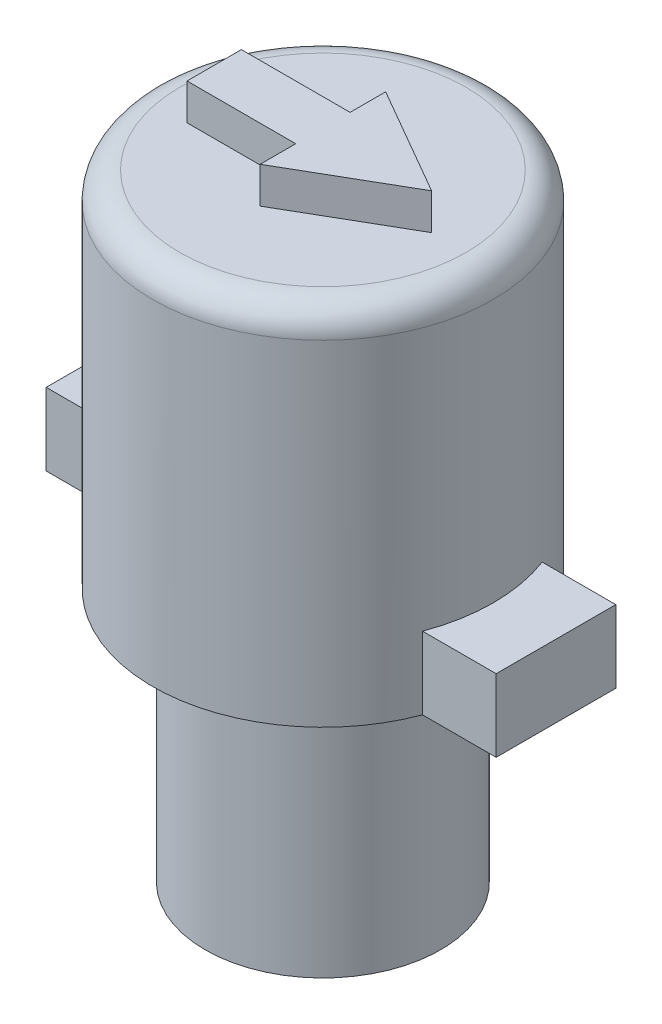
ISO-10303-21;
HEADER;
FILE_DESCRIPTION(('STEP AP214'),'2;1');
FILE_NAME('part.step','',(''),(''),'','','');
FILE_SCHEMA(('AUTOMOTIVE_DESIGN { 1 0 10303 214 1 1 1 1 }'));
ENDSEC;
DATA;
#1=APPLICATION_CONTEXT('core data for automotive mechanical design processes');
#2=APPLICATION_PROTOCOL_DEFINITION('international standard','automotive_design',2000,#1);
#3=PRODUCT_CONTEXT('',#1,'mechanical');
#4=PRODUCT('Part','Part','',(#3));
#5=PRODUCT_RELATED_PRODUCT_CATEGORY('part','',(#4));
#6=PRODUCT_DEFINITION_FORMATION('','',#4);
#7=PRODUCT_DEFINITION_CONTEXT('part definition',#1,'design');
#8=PRODUCT_DEFINITION('design','',#6,#7);
#9=PRODUCT_DEFINITION_SHAPE('','',#8);
#10=(LENGTH_UNIT() NAMED_UNIT(*) SI_UNIT(.MILLI.,.METRE.));
#11=(NAMED_UNIT(*) PLANE_ANGLE_UNIT() SI_UNIT($,.RADIAN.));
#12=(NAMED_UNIT(*) SI_UNIT($,.STERADIAN.) SOLID_ANGLE_UNIT());
#13=UNCERTAINTY_MEASURE_WITH_UNIT(LENGTH_MEASURE(1.E-05),#10,'distance_accuracy_value','');
#14=(GEOMETRIC_REPRESENTATION_CONTEXT(3) GLOBAL_UNCERTAINTY_ASSIGNED_CONTEXT((#13)) GLOBAL_UNIT_ASSIGNED_CONTEXT((#10,
#11,#12)) REPRESENTATION_CONTEXT('',''));
#15=CARTESIAN_POINT('',(0.,0.,0.));
#16=DIRECTION('',(0.,0.,1.));
#17=DIRECTION('',(1.,0.,0.));
#18=AXIS2_PLACEMENT_3D('',#15,#16,#17);
#19=CARTESIAN_POINT('',(0.,17.018,0.));
#20=DIRECTION('',(0.,1.,0.));
#21=DIRECTION('',(0.,0.,1.));
#22=AXIS2_PLACEMENT_3D('',#19,#20,#21);
#23=PLANE('',#22);
#24=CARTESIAN_POINT('',(0.,17.018,0.));
#25=DIRECTION('',(0.,1.,0.));
#26=DIRECTION('',(0.,0.,1.));
#27=AXIS2_PLACEMENT_3D('',#24,#25,#26);
#28=CIRCLE('',#27,3.95);
#29=CARTESIAN_POINT('',(0.,17.018,3.95));
#30=VERTEX_POINT('',#29);
#31=EDGE_CURVE('E72',#30,#30,#28,.T.);
#32=ORIENTED_EDGE('',*,*,#31,.T.);
#33=EDGE_LOOP('',(#32));
#34=FACE_BOUND('',#33,.T.);
#35=DIRECTION('',(-1.,0.,0.));
#36=VECTOR('',#35,1.);
#37=CARTESIAN_POINT('',(0.,17.018,-0.75));
#38=LINE('',#37,#36);
#39=CARTESIAN_POINT('',(0.,17.018,-0.75));
#40=VERTEX_POINT('',#39);
#41=CARTESIAN_POINT('',(-3.,17.018,-0.75));
#42=VERTEX_POINT('',#41);
#43=EDGE_CURVE('E285',#40,#42,#38,.T.);
#44=ORIENTED_EDGE('',*,*,#43,.F.);
#45=DIRECTION('',(0.,0.,1.));
#46=VECTOR('',#45,1.);
#47=CARTESIAN_POINT('',(0.,17.018,-1.73205080756888));
#48=LINE('',#47,#46);
#49=CARTESIAN_POINT('',(0.,17.018,-1.73205080756888));
#50=VERTEX_POINT('',#49);
#51=EDGE_CURVE('E213',#50,#40,#48,.T.);
#52=ORIENTED_EDGE('',*,*,#51,.F.);
#53=DIRECTION('',(-0.866025403784438,0.,-0.5));
#54=VECTOR('',#53,1.);
#55=CARTESIAN_POINT('',(3.,17.018,0.));
#56=LINE('',#55,#54);
#57=CARTESIAN_POINT('',(3.,17.018,0.));
#58=VERTEX_POINT('',#57);
#59=EDGE_CURVE('E263',#58,#50,#56,.T.);
#60=ORIENTED_EDGE('',*,*,#59,.F.);
#61=DIRECTION('',(0.866025403784439,0.,-0.5));
#62=VECTOR('',#61,1.);
#63=CARTESIAN_POINT('',(0.,17.018,1.73205080756888));
#64=LINE('',#63,#62);
#65=CARTESIAN_POINT('',(0.,17.018,1.73205080756888));
#66=VERTEX_POINT('',#65);
#67=EDGE_CURVE('E297',#66,#58,#64,.T.);
#68=ORIENTED_EDGE('',*,*,#67,.F.);
#69=DIRECTION('',(0.,0.,1.));
#70=VECTOR('',#69,1.);
#71=CARTESIAN_POINT('',(0.,17.018,0.75));
#72=LINE('',#71,#70);
#73=CARTESIAN_POINT('',(0.,17.018,0.75));
#74=VERTEX_POINT('',#73);
#75=EDGE_CURVE('E294',#74,#66,#72,.T.);
#76=ORIENTED_EDGE('',*,*,#75,.F.);
#77=DIRECTION('',(1.,0.,0.));
#78=VECTOR('',#77,1.);
#79=CARTESIAN_POINT('',(-3.,17.018,0.75));
#80=LINE('',#79,#78);
#81=CARTESIAN_POINT('',(-3.,17.018,0.75));
#82=VERTEX_POINT('',#81);
#83=EDGE_CURVE('E291',#82,#74,#80,.T.);
#84=ORIENTED_EDGE('',*,*,#83,.F.);
#85=DIRECTION('',(0.,0.,1.));
#86=VECTOR('',#85,1.);
#87=CARTESIAN_POINT('',(-3.,17.018,-0.75));
#88=LINE('',#87,#86);
#89=EDGE_CURVE('E288',#42,#82,#88,.T.);
#90=ORIENTED_EDGE('',*,*,#89,.F.);
#91=EDGE_LOOP('',(#44,#52,#60,#68,#76,#84,#90));
#92=FACE_BOUND('',#91,.T.);
#93=ADVANCED_FACE('F63',(#34,#92),#23,.T.);
#94=CARTESIAN_POINT('',(0.,7.018,0.));
#95=DIRECTION('',(0.,-1.,0.));
#96=DIRECTION('',(0.,0.,-1.));
#97=AXIS2_PLACEMENT_3D('',#94,#95,#96);
#98=CYLINDRICAL_SURFACE('',#97,3.25);
#99=CARTESIAN_POINT('',(0.,7.018,0.));
#100=DIRECTION('',(0.,1.,0.));
#101=DIRECTION('',(0.,0.,1.));
#102=AXIS2_PLACEMENT_3D('',#99,#100,#101);
#103=CIRCLE('',#102,3.25);
#104=CARTESIAN_POINT('',(0.,7.018,3.25));
#105=VERTEX_POINT('',#104);
#106=EDGE_CURVE('E332',#105,#105,#103,.T.);
#107=ORIENTED_EDGE('',*,*,#106,.F.);
#108=EDGE_LOOP('',(#107));
#109=FACE_BOUND('',#108,.T.);
#110=CARTESIAN_POINT('',(0.,0.,0.));
#111=DIRECTION('',(0.,1.,0.));
#112=DIRECTION('',(0.,0.,1.));
#113=AXIS2_PLACEMENT_3D('',#110,#111,#112);
#114=CIRCLE('',#113,3.25);
#115=CARTESIAN_POINT('',(0.,0.,3.25));
#116=VERTEX_POINT('',#115);
#117=EDGE_CURVE('E336',#116,#116,#114,.T.);
#118=ORIENTED_EDGE('',*,*,#117,.T.);
#119=EDGE_LOOP('',(#118));
#120=FACE_BOUND('',#119,.T.);
#121=ADVANCED_FACE('F362',(#109,#120),#98,.T.);
#122=CARTESIAN_POINT('',(0.,0.,0.));
#123=DIRECTION('',(0.,1.,0.));
#124=DIRECTION('',(0.,0.,1.));
#125=AXIS2_PLACEMENT_3D('',#122,#123,#124);
#126=PLANE('',#125);
#127=ORIENTED_EDGE('',*,*,#117,.F.);
#128=EDGE_LOOP('',(#127));
#129=FACE_BOUND('',#128,.T.);
#130=ADVANCED_FACE('F367',(#129),#126,.F.);
#131=CARTESIAN_POINT('',(0.,17.018,0.));
#132=DIRECTION('',(0.,-1.,0.));
#133=DIRECTION('',(0.,0.,-1.));
#134=AXIS2_PLACEMENT_3D('',#131,#132,#133);
#135=CYLINDRICAL_SURFACE('',#134,4.7);
#136=CARTESIAN_POINT('',(0.,7.018,0.));
#137=DIRECTION('',(0.,1.,0.));
#138=DIRECTION('',(0.,0.,1.));
#139=AXIS2_PLACEMENT_3D('',#136,#137,#138);
#140=CIRCLE('',#139,4.7);
#141=CARTESIAN_POINT('',(4.4004771332209,7.018,-1.651));
#142=VERTEX_POINT('',#141);
#143=CARTESIAN_POINT('',(-4.58887175676113,7.018,-1.016));
#144=VERTEX_POINT('',#143);
#145=EDGE_CURVE('E331',#142,#144,#140,.T.);
#146=ORIENTED_EDGE('',*,*,#145,.T.);
#147=DIRECTION('',(0.,-1.,0.));
#148=VECTOR('',#147,1.);
#149=CARTESIAN_POINT('',(-4.58887175676113,9.018,-1.016));
#150=LINE('',#149,#148);
#151=CARTESIAN_POINT('',(-4.58887175676113,9.018,-1.016));
#152=VERTEX_POINT('',#151);
#153=EDGE_CURVE('E79',#152,#144,#150,.T.);
#154=ORIENTED_EDGE('',*,*,#153,.F.);
#155=CARTESIAN_POINT('',(0.,9.018,0.));
#156=DIRECTION('',(0.,1.,0.));
#157=DIRECTION('',(0.,0.,-1.));
#158=AXIS2_PLACEMENT_3D('',#155,#156,#157);
#159=CIRCLE('',#158,4.7);
#160=CARTESIAN_POINT('',(-4.58887175676113,9.018,1.016));
#161=VERTEX_POINT('',#160);
#162=EDGE_CURVE('E83',#152,#161,#159,.T.);
#163=ORIENTED_EDGE('',*,*,#162,.T.);
#164=DIRECTION('',(0.,-1.,0.));
#165=VECTOR('',#164,1.);
#166=CARTESIAN_POINT('',(-4.58887175676113,9.018,1.016));
#167=LINE('',#166,#165);
#168=CARTESIAN_POINT('',(-4.58887175676113,7.018,1.016));
#169=VERTEX_POINT('',#168);
#170=EDGE_CURVE('E183',#161,#169,#167,.T.);
#171=ORIENTED_EDGE('',*,*,#170,.T.);
#172=CARTESIAN_POINT('',(4.4004771332209,7.018,1.651));
#173=VERTEX_POINT('',#172);
#174=EDGE_CURVE('E328',#169,#173,#140,.T.);
#175=ORIENTED_EDGE('',*,*,#174,.T.);
#176=DIRECTION('',(0.,-1.,0.));
#177=VECTOR('',#176,1.);
#178=CARTESIAN_POINT('',(4.4004771332209,9.018,1.651));
#179=LINE('',#178,#177);
#180=CARTESIAN_POINT('',(4.4004771332209,9.018,1.651));
#181=VERTEX_POINT('',#180);
#182=EDGE_CURVE('E229',#181,#173,#179,.T.);
#183=ORIENTED_EDGE('',*,*,#182,.F.);
#184=CARTESIAN_POINT('',(0.,9.018,0.));
#185=DIRECTION('',(0.,1.,0.));
#186=DIRECTION('',(0.,0.,-1.));
#187=AXIS2_PLACEMENT_3D('',#184,#185,#186);
#188=CIRCLE('',#187,4.7);
#189=CARTESIAN_POINT('',(4.4004771332209,9.018,-1.651));
#190=VERTEX_POINT('',#189);
#191=EDGE_CURVE('E238',#181,#190,#188,.T.);
#192=ORIENTED_EDGE('',*,*,#191,.T.);
#193=DIRECTION('',(0.,-1.,0.));
#194=VECTOR('',#193,1.);
#195=CARTESIAN_POINT('',(4.4004771332209,9.018,-1.651));
#196=LINE('',#195,#194);
#197=EDGE_CURVE('E218',#190,#142,#196,.T.);
#198=ORIENTED_EDGE('',*,*,#197,.T.);
#199=EDGE_LOOP('',(#146,#154,#163,#171,#175,#183,#192,#198));
#200=FACE_BOUND('',#199,.T.);
#201=CARTESIAN_POINT('',(0.,16.268,0.));
#202=DIRECTION('',(0.,1.,0.));
#203=DIRECTION('',(0.,0.,1.));
#204=AXIS2_PLACEMENT_3D('',#201,#202,#203);
#205=CIRCLE('',#204,4.7);
#206=CARTESIAN_POINT('',(0.,16.268,4.7));
#207=VERTEX_POINT('',#206);
#208=EDGE_CURVE('E12',#207,#207,#205,.F.);
#209=ORIENTED_EDGE('',*,*,#208,.T.);
#210=EDGE_LOOP('',(#209));
#211=FACE_BOUND('',#210,.T.);
#212=ADVANCED_FACE('F358',(#200,#211),#135,.T.);
#213=CARTESIAN_POINT('',(0.,7.018,0.));
#214=DIRECTION('',(0.,1.,0.));
#215=DIRECTION('',(0.,0.,1.));
#216=AXIS2_PLACEMENT_3D('',#213,#214,#215);
#217=PLANE('',#216);
#218=ORIENTED_EDGE('',*,*,#106,.T.);
#219=EDGE_LOOP('',(#218));
#220=FACE_BOUND('',#219,.T.);
#221=ORIENTED_EDGE('',*,*,#145,.F.);
#222=DIRECTION('',(1.,0.,0.));
#223=VECTOR('',#222,1.);
#224=CARTESIAN_POINT('',(6.4324771332209,7.018,-1.651));
#225=LINE('',#224,#223);
#226=CARTESIAN_POINT('',(6.4324771332209,7.018,-1.651));
#227=VERTEX_POINT('',#226);
#228=EDGE_CURVE('E205',#142,#227,#225,.T.);
#229=ORIENTED_EDGE('',*,*,#228,.T.);
#230=DIRECTION('',(0.,0.,1.));
#231=VECTOR('',#230,1.);
#232=CARTESIAN_POINT('',(6.4324771332209,7.018,1.651));
#233=LINE('',#232,#231);
#234=CARTESIAN_POINT('',(6.4324771332209,7.018,1.651));
#235=VERTEX_POINT('',#234);
#236=EDGE_CURVE('E237',#227,#235,#233,.T.);
#237=ORIENTED_EDGE('',*,*,#236,.T.);
#238=DIRECTION('',(-1.,0.,0.));
#239=VECTOR('',#238,1.);
#240=CARTESIAN_POINT('',(4.4004771332209,7.018,1.651));
#241=LINE('',#240,#239);
#242=EDGE_CURVE('E233',#235,#173,#241,.T.);
#243=ORIENTED_EDGE('',*,*,#242,.T.);
#244=ORIENTED_EDGE('',*,*,#174,.F.);
#245=DIRECTION('',(-1.,0.,0.));
#246=VECTOR('',#245,1.);
#247=CARTESIAN_POINT('',(-4.58887175676113,7.018,1.016));
#248=LINE('',#247,#246);
#249=CARTESIAN_POINT('',(-6.62087175676113,7.018,1.016));
#250=VERTEX_POINT('',#249);
#251=EDGE_CURVE('E202',#169,#250,#248,.T.);
#252=ORIENTED_EDGE('',*,*,#251,.T.);
#253=DIRECTION('',(0.,0.,-1.));
#254=VECTOR('',#253,1.);
#255=CARTESIAN_POINT('',(-6.62087175676113,7.018,1.016));
#256=LINE('',#255,#254);
#257=CARTESIAN_POINT('',(-6.62087175676113,7.018,-1.016));
#258=VERTEX_POINT('',#257);
#259=EDGE_CURVE('E176',#250,#258,#256,.T.);
#260=ORIENTED_EDGE('',*,*,#259,.T.);
#261=DIRECTION('',(1.,0.,0.));
#262=VECTOR('',#261,1.);
#263=CARTESIAN_POINT('',(-6.62087175676113,7.018,-1.016));
#264=LINE('',#263,#262);
#265=EDGE_CURVE('E197',#258,#144,#264,.T.);
#266=ORIENTED_EDGE('',*,*,#265,.T.);
#267=EDGE_LOOP('',(#221,#229,#237,#243,#244,#252,#260,#266));
#268=FACE_BOUND('',#267,.T.);
#269=ADVANCED_FACE('F347',(#220,#268),#217,.F.);
#270=CARTESIAN_POINT('',(0.,16.268,0.));
#271=DIRECTION('',(0.,1.,0.));
#272=DIRECTION('',(0.,0.,1.));
#273=AXIS2_PLACEMENT_3D('',#270,#271,#272);
#274=TOROIDAL_SURFACE('',#273,3.95,0.75);
#275=ORIENTED_EDGE('',*,*,#208,.F.);
#276=EDGE_LOOP('',(#275));
#277=FACE_BOUND('',#276,.T.);
#278=ORIENTED_EDGE('',*,*,#31,.F.);
#279=EDGE_LOOP('',(#278));
#280=FACE_BOUND('',#279,.T.);
#281=ADVANCED_FACE('F65',(#277,#280),#274,.T.);
#282=CARTESIAN_POINT('',(0.,18.018,-1.73205080756888));
#283=DIRECTION('',(1.,0.,0.));
#284=DIRECTION('',(0.,0.,-1.));
#285=AXIS2_PLACEMENT_3D('',#282,#283,#284);
#286=PLANE('',#285);
#287=ORIENTED_EDGE('',*,*,#51,.T.);
#288=DIRECTION('',(0.,-1.,0.));
#289=VECTOR('',#288,1.);
#290=CARTESIAN_POINT('',(0.,18.018,-0.75));
#291=LINE('',#290,#289);
#292=CARTESIAN_POINT('',(0.,18.018,-0.75));
#293=VERTEX_POINT('',#292);
#294=EDGE_CURVE('E325',#293,#40,#291,.T.);
#295=ORIENTED_EDGE('',*,*,#294,.F.);
#296=DIRECTION('',(0.,0.,1.));
#297=VECTOR('',#296,1.);
#298=CARTESIAN_POINT('',(0.,18.018,-1.73205080756888));
#299=LINE('',#298,#297);
#300=CARTESIAN_POINT('',(0.,18.018,-1.73205080756888));
#301=VERTEX_POINT('',#300);
#302=EDGE_CURVE('E258',#301,#293,#299,.T.);
#303=ORIENTED_EDGE('',*,*,#302,.F.);
#304=DIRECTION('',(0.,-1.,0.));
#305=VECTOR('',#304,1.);
#306=CARTESIAN_POINT('',(0.,18.018,-1.73205080756888));
#307=LINE('',#306,#305);
#308=EDGE_CURVE('E281',#301,#50,#307,.T.);
#309=ORIENTED_EDGE('',*,*,#308,.T.);
#310=EDGE_LOOP('',(#287,#295,#303,#309));
#311=FACE_BOUND('',#310,.T.);
#312=ADVANCED_FACE('F346',(#311),#286,.F.);
#313=CARTESIAN_POINT('',(0.,18.018,-0.75));
#314=DIRECTION('',(0.,0.,1.));
#315=DIRECTION('',(1.,0.,0.));
#316=AXIS2_PLACEMENT_3D('',#313,#314,#315);
#317=PLANE('',#316);
#318=ORIENTED_EDGE('',*,*,#43,.T.);
#319=DIRECTION('',(0.,-1.,0.));
#320=VECTOR('',#319,1.);
#321=CARTESIAN_POINT('',(-3.,18.018,-0.75));
#322=LINE('',#321,#320);
#323=CARTESIAN_POINT('',(-3.,18.018,-0.75));
#324=VERTEX_POINT('',#323);
#325=EDGE_CURVE('E321',#324,#42,#322,.T.);
#326=ORIENTED_EDGE('',*,*,#325,.F.);
#327=DIRECTION('',(-1.,0.,0.));
#328=VECTOR('',#327,1.);
#329=CARTESIAN_POINT('',(0.,18.018,-0.75));
#330=LINE('',#329,#328);
#331=EDGE_CURVE('E262',#293,#324,#330,.T.);
#332=ORIENTED_EDGE('',*,*,#331,.F.);
#333=ORIENTED_EDGE('',*,*,#294,.T.);
#334=EDGE_LOOP('',(#318,#326,#332,#333));
#335=FACE_BOUND('',#334,.T.);
#336=ADVANCED_FACE('F354',(#335),#317,.F.);
#337=CARTESIAN_POINT('',(-3.,18.018,-0.75));
#338=DIRECTION('',(1.,0.,0.));
#339=DIRECTION('',(0.,0.,-1.));
#340=AXIS2_PLACEMENT_3D('',#337,#338,#339);
#341=PLANE('',#340);
#342=ORIENTED_EDGE('',*,*,#89,.T.);
#343=DIRECTION('',(0.,-1.,0.));
#344=VECTOR('',#343,1.);
#345=CARTESIAN_POINT('',(-3.,18.018,0.75));
#346=LINE('',#345,#344);
#347=CARTESIAN_POINT('',(-3.,18.018,0.75));
#348=VERTEX_POINT('',#347);
#349=EDGE_CURVE('E317',#348,#82,#346,.T.);
#350=ORIENTED_EDGE('',*,*,#349,.F.);
#351=DIRECTION('',(0.,0.,1.));
#352=VECTOR('',#351,1.);
#353=CARTESIAN_POINT('',(-3.,18.018,-0.75));
#354=LINE('',#353,#352);
#355=EDGE_CURVE('E266',#324,#348,#354,.T.);
#356=ORIENTED_EDGE('',*,*,#355,.F.);
#357=ORIENTED_EDGE('',*,*,#325,.T.);
#358=EDGE_LOOP('',(#342,#350,#356,#357));
#359=FACE_BOUND('',#358,.T.);
#360=ADVANCED_FACE('F417',(#359),#341,.F.);
#361=CARTESIAN_POINT('',(-3.,18.018,0.75));
#362=DIRECTION('',(0.,0.,-1.));
#363=DIRECTION('',(-1.,0.,0.));
#364=AXIS2_PLACEMENT_3D('',#361,#362,#363);
#365=PLANE('',#364);
#366=ORIENTED_EDGE('',*,*,#83,.T.);
#367=DIRECTION('',(0.,-1.,0.));
#368=VECTOR('',#367,1.);
#369=CARTESIAN_POINT('',(0.,18.018,0.75));
#370=LINE('',#369,#368);
#371=CARTESIAN_POINT('',(0.,18.018,0.75));
#372=VERTEX_POINT('',#371);
#373=EDGE_CURVE('E313',#372,#74,#370,.T.);
#374=ORIENTED_EDGE('',*,*,#373,.F.);
#375=DIRECTION('',(1.,0.,0.));
#376=VECTOR('',#375,1.);
#377=CARTESIAN_POINT('',(-3.,18.018,0.75));
#378=LINE('',#377,#376);
#379=EDGE_CURVE('E269',#348,#372,#378,.T.);
#380=ORIENTED_EDGE('',*,*,#379,.F.);
#381=ORIENTED_EDGE('',*,*,#349,.T.);
#382=EDGE_LOOP('',(#366,#374,#380,#381));
#383=FACE_BOUND('',#382,.T.);
#384=ADVANCED_FACE('F425',(#383),#365,.F.);
#385=CARTESIAN_POINT('',(0.,18.018,0.75));
#386=DIRECTION('',(1.,0.,0.));
#387=DIRECTION('',(0.,0.,-1.));
#388=AXIS2_PLACEMENT_3D('',#385,#386,#387);
#389=PLANE('',#388);
#390=ORIENTED_EDGE('',*,*,#75,.T.);
#391=DIRECTION('',(0.,-1.,0.));
#392=VECTOR('',#391,1.);
#393=CARTESIAN_POINT('',(0.,18.018,1.73205080756888));
#394=LINE('',#393,#392);
#395=CARTESIAN_POINT('',(0.,18.018,1.73205080756888));
#396=VERTEX_POINT('',#395);
#397=EDGE_CURVE('E309',#396,#66,#394,.T.);
#398=ORIENTED_EDGE('',*,*,#397,.F.);
#399=DIRECTION('',(0.,0.,1.));
#400=VECTOR('',#399,1.);
#401=CARTESIAN_POINT('',(0.,18.018,0.75));
#402=LINE('',#401,#400);
#403=EDGE_CURVE('E272',#372,#396,#402,.T.);
#404=ORIENTED_EDGE('',*,*,#403,.F.);
#405=ORIENTED_EDGE('',*,*,#373,.T.);
#406=EDGE_LOOP('',(#390,#398,#404,#405));
#407=FACE_BOUND('',#406,.T.);
#408=ADVANCED_FACE('F434',(#407),#389,.F.);
#409=CARTESIAN_POINT('',(0.,18.018,1.73205080756888));
#410=DIRECTION('',(-0.5,0.,-0.866025403784439));
#411=DIRECTION('',(-0.866025403784439,0.,0.5));
#412=AXIS2_PLACEMENT_3D('',#409,#410,#411);
#413=PLANE('',#412);
#414=ORIENTED_EDGE('',*,*,#67,.T.);
#415=DIRECTION('',(0.,-1.,0.));
#416=VECTOR('',#415,1.);
#417=CARTESIAN_POINT('',(3.,18.018,0.));
#418=LINE('',#417,#416);
#419=CARTESIAN_POINT('',(3.,18.018,0.));
#420=VERTEX_POINT('',#419);
#421=EDGE_CURVE('E306',#420,#58,#418,.T.);
#422=ORIENTED_EDGE('',*,*,#421,.F.);
#423=DIRECTION('',(0.866025403784439,0.,-0.5));
#424=VECTOR('',#423,1.);
#425=CARTESIAN_POINT('',(0.,18.018,1.73205080756888));
#426=LINE('',#425,#424);
#427=EDGE_CURVE('E275',#396,#420,#426,.T.);
#428=ORIENTED_EDGE('',*,*,#427,.F.);
#429=ORIENTED_EDGE('',*,*,#397,.T.);
#430=EDGE_LOOP('',(#414,#422,#428,#429));
#431=FACE_BOUND('',#430,.T.);
#432=ADVANCED_FACE('F443',(#431),#413,.F.);
#433=CARTESIAN_POINT('',(3.,18.018,0.));
#434=DIRECTION('',(-0.5,0.,0.866025403784438));
#435=DIRECTION('',(0.866025403784438,0.,0.5));
#436=AXIS2_PLACEMENT_3D('',#433,#434,#435);
#437=PLANE('',#436);
#438=ORIENTED_EDGE('',*,*,#59,.T.);
#439=ORIENTED_EDGE('',*,*,#308,.F.);
#440=DIRECTION('',(-0.866025403784438,0.,-0.5));
#441=VECTOR('',#440,1.);
#442=CARTESIAN_POINT('',(3.,18.018,0.));
#443=LINE('',#442,#441);
#444=EDGE_CURVE('E278',#420,#301,#443,.T.);
#445=ORIENTED_EDGE('',*,*,#444,.F.);
#446=ORIENTED_EDGE('',*,*,#421,.T.);
#447=EDGE_LOOP('',(#438,#439,#445,#446));
#448=FACE_BOUND('',#447,.T.);
#449=ADVANCED_FACE('F452',(#448),#437,.F.);
#450=CARTESIAN_POINT('',(0.,18.018,0.));
#451=DIRECTION('',(0.,-1.,0.));
#452=DIRECTION('',(0.,0.,-1.));
#453=AXIS2_PLACEMENT_3D('',#450,#451,#452);
#454=PLANE('',#453);
#455=ORIENTED_EDGE('',*,*,#302,.T.);
#456=ORIENTED_EDGE('',*,*,#331,.T.);
#457=ORIENTED_EDGE('',*,*,#355,.T.);
#458=ORIENTED_EDGE('',*,*,#379,.T.);
#459=ORIENTED_EDGE('',*,*,#403,.T.);
#460=ORIENTED_EDGE('',*,*,#427,.T.);
#461=ORIENTED_EDGE('',*,*,#444,.T.);
#462=EDGE_LOOP('',(#455,#456,#457,#458,#459,#460,#461));
#463=FACE_BOUND('',#462,.T.);
#464=ADVANCED_FACE('F461',(#463),#454,.F.);
#465=CARTESIAN_POINT('',(4.4004771332209,9.018,1.651));
#466=DIRECTION('',(0.,0.,1.));
#467=DIRECTION('',(1.,0.,0.));
#468=AXIS2_PLACEMENT_3D('',#465,#466,#467);
#469=PLANE('',#468);
#470=ORIENTED_EDGE('',*,*,#242,.F.);
#471=DIRECTION('',(0.,-1.,0.));
#472=VECTOR('',#471,1.);
#473=CARTESIAN_POINT('',(6.4324771332209,9.018,1.651));
#474=LINE('',#473,#472);
#475=CARTESIAN_POINT('',(6.4324771332209,9.018,1.651));
#476=VERTEX_POINT('',#475);
#477=EDGE_CURVE('E226',#476,#235,#474,.T.);
#478=ORIENTED_EDGE('',*,*,#477,.F.);
#479=DIRECTION('',(-1.,0.,0.));
#480=VECTOR('',#479,1.);
#481=CARTESIAN_POINT('',(4.4004771332209,9.018,1.651));
#482=LINE('',#481,#480);
#483=EDGE_CURVE('E222',#476,#181,#482,.T.);
#484=ORIENTED_EDGE('',*,*,#483,.T.);
#485=ORIENTED_EDGE('',*,*,#182,.T.);
#486=EDGE_LOOP('',(#470,#478,#484,#485));
#487=FACE_BOUND('',#486,.T.);
#488=ADVANCED_FACE('F470',(#487),#469,.T.);
#489=CARTESIAN_POINT('',(6.4324771332209,9.018,1.651));
#490=DIRECTION('',(1.,0.,0.));
#491=DIRECTION('',(0.,0.,-1.));
#492=AXIS2_PLACEMENT_3D('',#489,#490,#491);
#493=PLANE('',#492);
#494=ORIENTED_EDGE('',*,*,#236,.F.);
#495=DIRECTION('',(0.,-1.,0.));
#496=VECTOR('',#495,1.);
#497=CARTESIAN_POINT('',(6.4324771332209,9.018,-1.651));
#498=LINE('',#497,#496);
#499=CARTESIAN_POINT('',(6.4324771332209,9.018,-1.651));
#500=VERTEX_POINT('',#499);
#501=EDGE_CURVE('E223',#500,#227,#498,.T.);
#502=ORIENTED_EDGE('',*,*,#501,.F.);
#503=DIRECTION('',(0.,0.,1.));
#504=VECTOR('',#503,1.);
#505=CARTESIAN_POINT('',(6.4324771332209,9.018,1.651));
#506=LINE('',#505,#504);
#507=EDGE_CURVE('E248',#500,#476,#506,.T.);
#508=ORIENTED_EDGE('',*,*,#507,.T.);
#509=ORIENTED_EDGE('',*,*,#477,.T.);
#510=EDGE_LOOP('',(#494,#502,#508,#509));
#511=FACE_BOUND('',#510,.T.);
#512=ADVANCED_FACE('F479',(#511),#493,.T.);
#513=CARTESIAN_POINT('',(6.4324771332209,9.018,-1.651));
#514=DIRECTION('',(0.,0.,-1.));
#515=DIRECTION('',(-1.,0.,0.));
#516=AXIS2_PLACEMENT_3D('',#513,#514,#515);
#517=PLANE('',#516);
#518=ORIENTED_EDGE('',*,*,#228,.F.);
#519=ORIENTED_EDGE('',*,*,#197,.F.);
#520=DIRECTION('',(1.,0.,0.));
#521=VECTOR('',#520,1.);
#522=CARTESIAN_POINT('',(6.4324771332209,9.018,-1.651));
#523=LINE('',#522,#521);
#524=EDGE_CURVE('E252',#190,#500,#523,.T.);
#525=ORIENTED_EDGE('',*,*,#524,.T.);
#526=ORIENTED_EDGE('',*,*,#501,.T.);
#527=EDGE_LOOP('',(#518,#519,#525,#526));
#528=FACE_BOUND('',#527,.T.);
#529=ADVANCED_FACE('F489',(#528),#517,.T.);
#530=CARTESIAN_POINT('',(0.,9.018,0.));
#531=DIRECTION('',(0.,-1.,0.));
#532=DIRECTION('',(0.,0.,-1.));
#533=AXIS2_PLACEMENT_3D('',#530,#531,#532);
#534=PLANE('',#533);
#535=ORIENTED_EDGE('',*,*,#191,.F.);
#536=ORIENTED_EDGE('',*,*,#483,.F.);
#537=ORIENTED_EDGE('',*,*,#507,.F.);
#538=ORIENTED_EDGE('',*,*,#524,.F.);
#539=EDGE_LOOP('',(#535,#536,#537,#538));
#540=FACE_BOUND('',#539,.T.);
#541=ADVANCED_FACE('F498',(#540),#534,.F.);
#542=CARTESIAN_POINT('',(-6.62087175676113,9.018,-1.016));
#543=DIRECTION('',(0.,0.,-1.));
#544=DIRECTION('',(-1.,0.,0.));
#545=AXIS2_PLACEMENT_3D('',#542,#543,#544);
#546=PLANE('',#545);
#547=ORIENTED_EDGE('',*,*,#265,.F.);
#548=DIRECTION('',(0.,-1.,0.));
#549=VECTOR('',#548,1.);
#550=CARTESIAN_POINT('',(-6.62087175676113,9.018,-1.016));
#551=LINE('',#550,#549);
#552=CARTESIAN_POINT('',(-6.62087175676113,9.018,-1.016));
#553=VERTEX_POINT('',#552);
#554=EDGE_CURVE('E182',#553,#258,#551,.T.);
#555=ORIENTED_EDGE('',*,*,#554,.F.);
#556=DIRECTION('',(1.,0.,0.));
#557=VECTOR('',#556,1.);
#558=CARTESIAN_POINT('',(-6.62087175676113,9.018,-1.016));
#559=LINE('',#558,#557);
#560=EDGE_CURVE('E190',#553,#152,#559,.T.);
#561=ORIENTED_EDGE('',*,*,#560,.T.);
#562=ORIENTED_EDGE('',*,*,#153,.T.);
#563=EDGE_LOOP('',(#547,#555,#561,#562));
#564=FACE_BOUND('',#563,.T.);
#565=ADVANCED_FACE('F507',(#564),#546,.T.);
#566=CARTESIAN_POINT('',(-6.62087175676113,9.018,1.016));
#567=DIRECTION('',(-1.,0.,0.));
#568=DIRECTION('',(0.,0.,1.));
#569=AXIS2_PLACEMENT_3D('',#566,#567,#568);
#570=PLANE('',#569);
#571=ORIENTED_EDGE('',*,*,#259,.F.);
#572=DIRECTION('',(0.,-1.,0.));
#573=VECTOR('',#572,1.);
#574=CARTESIAN_POINT('',(-6.62087175676113,9.018,1.016));
#575=LINE('',#574,#573);
#576=CARTESIAN_POINT('',(-6.62087175676113,9.018,1.016));
#577=VERTEX_POINT('',#576);
#578=EDGE_CURVE('E170',#577,#250,#575,.T.);
#579=ORIENTED_EDGE('',*,*,#578,.F.);
#580=DIRECTION('',(0.,0.,-1.));
#581=VECTOR('',#580,1.);
#582=CARTESIAN_POINT('',(-6.62087175676113,9.018,1.016));
#583=LINE('',#582,#581);
#584=EDGE_CURVE('E173',#577,#553,#583,.T.);
#585=ORIENTED_EDGE('',*,*,#584,.T.);
#586=ORIENTED_EDGE('',*,*,#554,.T.);
#587=EDGE_LOOP('',(#571,#579,#585,#586));
#588=FACE_BOUND('',#587,.T.);
#589=ADVANCED_FACE('F172',(#588),#570,.T.);
#590=CARTESIAN_POINT('',(-4.58887175676113,9.018,1.016));
#591=DIRECTION('',(0.,0.,1.));
#592=DIRECTION('',(1.,0.,0.));
#593=AXIS2_PLACEMENT_3D('',#590,#591,#592);
#594=PLANE('',#593);
#595=ORIENTED_EDGE('',*,*,#251,.F.);
#596=ORIENTED_EDGE('',*,*,#170,.F.);
#597=DIRECTION('',(-1.,0.,0.));
#598=VECTOR('',#597,1.);
#599=CARTESIAN_POINT('',(-4.58887175676113,9.018,1.016));
#600=LINE('',#599,#598);
#601=EDGE_CURVE('E188',#161,#577,#600,.T.);
#602=ORIENTED_EDGE('',*,*,#601,.T.);
#603=ORIENTED_EDGE('',*,*,#578,.T.);
#604=EDGE_LOOP('',(#595,#596,#602,#603));
#605=FACE_BOUND('',#604,.T.);
#606=ADVANCED_FACE('F193',(#605),#594,.T.);
#607=CARTESIAN_POINT('',(0.,9.018,0.));
#608=DIRECTION('',(0.,-1.,0.));
#609=DIRECTION('',(0.,0.,-1.));
#610=AXIS2_PLACEMENT_3D('',#607,#608,#609);
#611=PLANE('',#610);
#612=ORIENTED_EDGE('',*,*,#162,.F.);
#613=ORIENTED_EDGE('',*,*,#560,.F.);
#614=ORIENTED_EDGE('',*,*,#584,.F.);
#615=ORIENTED_EDGE('',*,*,#601,.F.);
#616=EDGE_LOOP('',(#612,#613,#614,#615));
#617=FACE_BOUND('',#616,.T.);
#618=ADVANCED_FACE('F187',(#617),#611,.F.);
#619=CLOSED_SHELL('',(#93,#121,#130,#212,#269,#281,#312,#336,#360,#384,#408,#432,#449,#464,#488,
#512,#529,#541,#565,#589,#606,#618));
#620=MANIFOLD_SOLID_BREP('B2',#619);
#621=ADVANCED_BREP_SHAPE_REPRESENTATION('',(#18,#620),#14);
#622=SHAPE_DEFINITION_REPRESENTATION(#9,#621);
ENDSEC;
END-ISO-10303-21;
